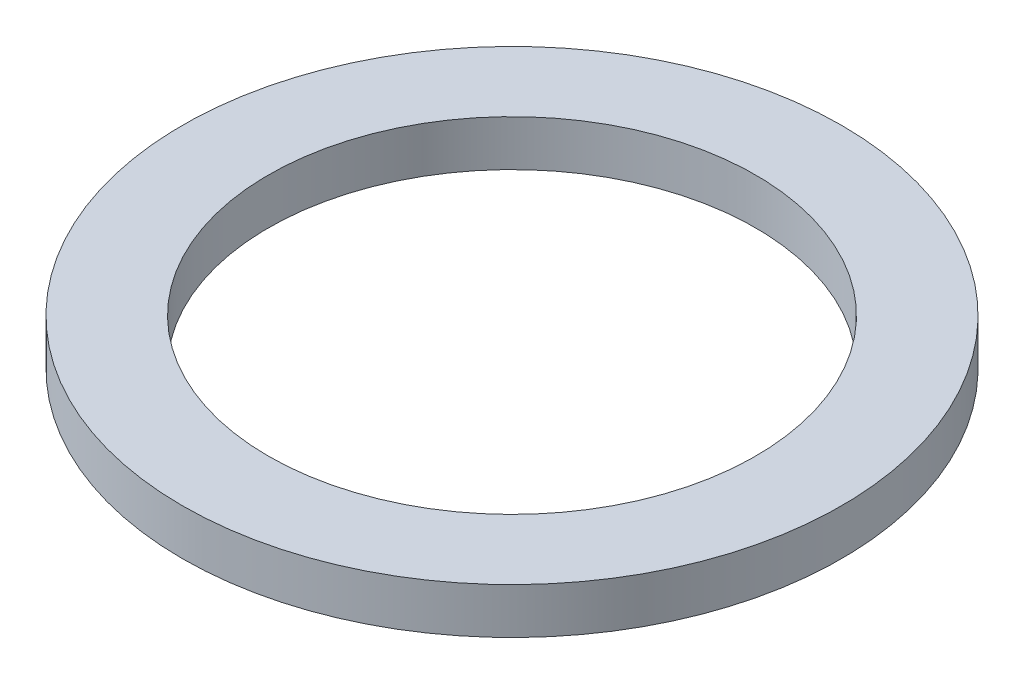
ISO-10303-21;
HEADER;
FILE_DESCRIPTION(('STEP AP214'),'2;1');
FILE_NAME('part.step','',(''),(''),'','','');
FILE_SCHEMA(('AUTOMOTIVE_DESIGN { 1 0 10303 214 1 1 1 1 }'));
ENDSEC;
DATA;
#1=APPLICATION_CONTEXT('core data for automotive mechanical design processes');
#2=APPLICATION_PROTOCOL_DEFINITION('international standard','automotive_design',2000,#1);
#3=PRODUCT_CONTEXT('',#1,'mechanical');
#4=PRODUCT('Part','Part','',(#3));
#5=PRODUCT_RELATED_PRODUCT_CATEGORY('part','',(#4));
#6=PRODUCT_DEFINITION_FORMATION('','',#4);
#7=PRODUCT_DEFINITION_CONTEXT('part definition',#1,'design');
#8=PRODUCT_DEFINITION('design','',#6,#7);
#9=PRODUCT_DEFINITION_SHAPE('','',#8);
#10=(LENGTH_UNIT() NAMED_UNIT(*) SI_UNIT(.MILLI.,.METRE.));
#11=(NAMED_UNIT(*) PLANE_ANGLE_UNIT() SI_UNIT($,.RADIAN.));
#12=(NAMED_UNIT(*) SI_UNIT($,.STERADIAN.) SOLID_ANGLE_UNIT());
#13=UNCERTAINTY_MEASURE_WITH_UNIT(LENGTH_MEASURE(1.E-05),#10,'distance_accuracy_value','');
#14=(GEOMETRIC_REPRESENTATION_CONTEXT(3) GLOBAL_UNCERTAINTY_ASSIGNED_CONTEXT((#13)) GLOBAL_UNIT_ASSIGNED_CONTEXT((#10,
#11,#12)) REPRESENTATION_CONTEXT('',''));
#15=CARTESIAN_POINT('',(0.,0.,0.));
#16=DIRECTION('',(0.,0.,1.));
#17=DIRECTION('',(1.,0.,0.));
#18=AXIS2_PLACEMENT_3D('',#15,#16,#17);
#19=CARTESIAN_POINT('',(0.,8.,0.));
#20=DIRECTION('',(0.,-1.,0.));
#21=DIRECTION('',(0.,0.,-1.));
#22=AXIS2_PLACEMENT_3D('',#19,#20,#21);
#23=CYLINDRICAL_SURFACE('',#22,57.5);
#24=CARTESIAN_POINT('',(0.,8.,0.));
#25=DIRECTION('',(0.,1.,0.));
#26=DIRECTION('',(0.,0.,1.));
#27=AXIS2_PLACEMENT_3D('',#24,#25,#26);
#28=CIRCLE('',#27,57.5);
#29=CARTESIAN_POINT('',(0.,8.,57.5));
#30=VERTEX_POINT('',#29);
#31=EDGE_CURVE('E10',#30,#30,#28,.T.);
#32=ORIENTED_EDGE('',*,*,#31,.F.);
#33=EDGE_LOOP('',(#32));
#34=FACE_BOUND('',#33,.T.);
#35=CARTESIAN_POINT('',(0.,0.,0.));
#36=DIRECTION('',(0.,1.,0.));
#37=DIRECTION('',(0.,0.,1.));
#38=AXIS2_PLACEMENT_3D('',#35,#36,#37);
#39=CIRCLE('',#38,57.5);
#40=CARTESIAN_POINT('',(0.,0.,57.5));
#41=VERTEX_POINT('',#40);
#42=EDGE_CURVE('E37',#41,#41,#39,.T.);
#43=ORIENTED_EDGE('',*,*,#42,.T.);
#44=EDGE_LOOP('',(#43));
#45=FACE_BOUND('',#44,.T.);
#46=ADVANCED_FACE('F40',(#34,#45),#23,.T.);
#47=CARTESIAN_POINT('',(0.,8.,0.));
#48=DIRECTION('',(0.,1.,0.));
#49=DIRECTION('',(0.,0.,1.));
#50=AXIS2_PLACEMENT_3D('',#47,#48,#49);
#51=PLANE('',#50);
#52=CARTESIAN_POINT('',(0.,8.,0.));
#53=DIRECTION('',(0.,1.,0.));
#54=DIRECTION('',(0.,0.,1.));
#55=AXIS2_PLACEMENT_3D('',#52,#53,#54);
#56=CIRCLE('',#55,42.5);
#57=CARTESIAN_POINT('',(0.,8.,42.5));
#58=VERTEX_POINT('',#57);
#59=EDGE_CURVE('E50',#58,#58,#56,.T.);
#60=ORIENTED_EDGE('',*,*,#59,.F.);
#61=EDGE_LOOP('',(#60));
#62=FACE_BOUND('',#61,.T.);
#63=ORIENTED_EDGE('',*,*,#31,.T.);
#64=EDGE_LOOP('',(#63));
#65=FACE_BOUND('',#64,.T.);
#66=ADVANCED_FACE('F59',(#62,#65),#51,.T.);
#67=CARTESIAN_POINT('',(0.,0.,0.));
#68=DIRECTION('',(0.,1.,0.));
#69=DIRECTION('',(0.,0.,1.));
#70=AXIS2_PLACEMENT_3D('',#67,#68,#69);
#71=PLANE('',#70);
#72=CARTESIAN_POINT('',(0.,0.,0.));
#73=DIRECTION('',(0.,1.,0.));
#74=DIRECTION('',(0.,0.,1.));
#75=AXIS2_PLACEMENT_3D('',#72,#73,#74);
#76=CIRCLE('',#75,42.5);
#77=CARTESIAN_POINT('',(0.,0.,42.5));
#78=VERTEX_POINT('',#77);
#79=EDGE_CURVE('E47',#78,#78,#76,.T.);
#80=ORIENTED_EDGE('',*,*,#79,.T.);
#81=EDGE_LOOP('',(#80));
#82=FACE_BOUND('',#81,.T.);
#83=ORIENTED_EDGE('',*,*,#42,.F.);
#84=EDGE_LOOP('',(#83));
#85=FACE_BOUND('',#84,.T.);
#86=ADVANCED_FACE('F58',(#82,#85),#71,.F.);
#87=CARTESIAN_POINT('',(0.,8.,0.));
#88=DIRECTION('',(0.,-1.,0.));
#89=DIRECTION('',(0.,0.,-1.));
#90=AXIS2_PLACEMENT_3D('',#87,#88,#89);
#91=CYLINDRICAL_SURFACE('',#90,42.5);
#92=ORIENTED_EDGE('',*,*,#59,.T.);
#93=EDGE_LOOP('',(#92));
#94=FACE_BOUND('',#93,.T.);
#95=ORIENTED_EDGE('',*,*,#79,.F.);
#96=EDGE_LOOP('',(#95));
#97=FACE_BOUND('',#96,.T.);
#98=ADVANCED_FACE('F54',(#94,#97),#91,.F.);
#99=CLOSED_SHELL('',(#46,#66,#86,#98));
#100=MANIFOLD_SOLID_BREP('B2',#99);
#101=ADVANCED_BREP_SHAPE_REPRESENTATION('',(#18,#100),#14);
#102=SHAPE_DEFINITION_REPRESENTATION(#9,#101);
ENDSEC;
END-ISO-10303-21;
